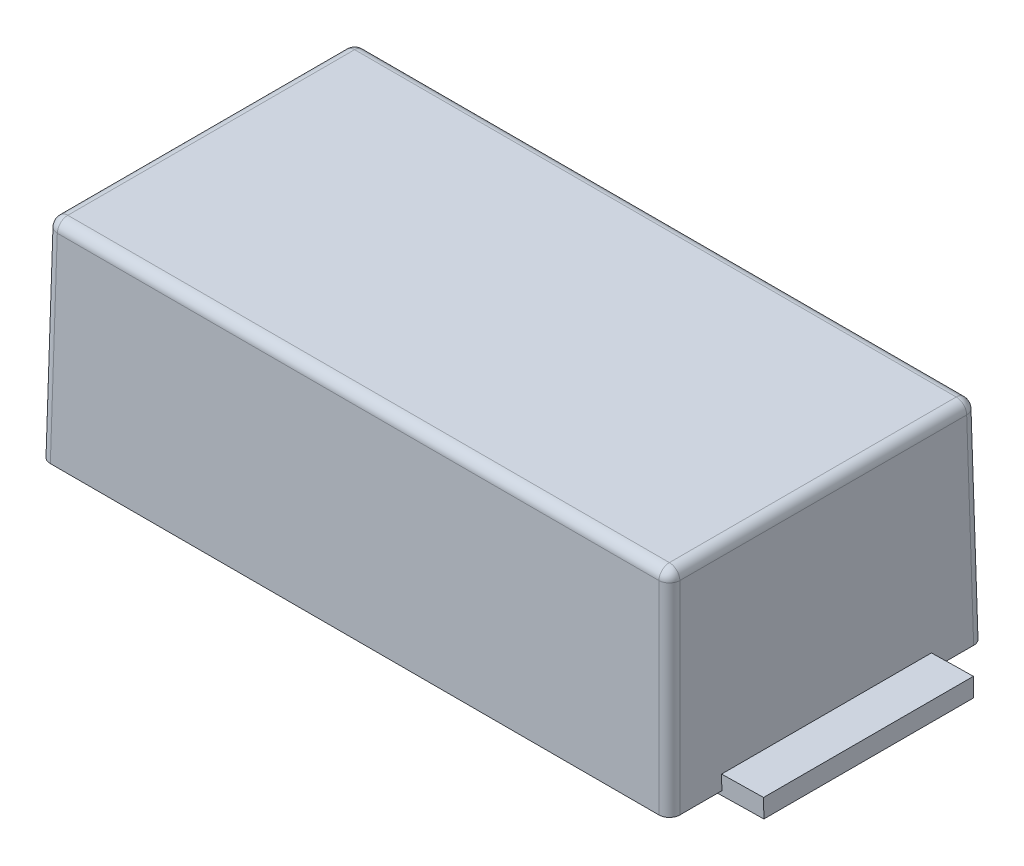
ISO-10303-21;
HEADER;
FILE_DESCRIPTION(('STEP AP214'),'2;1');
FILE_NAME('part.step','',(''),(''),'','','');
FILE_SCHEMA(('AUTOMOTIVE_DESIGN { 1 0 10303 214 1 1 1 1 }'));
ENDSEC;
DATA;
#1=APPLICATION_CONTEXT('core data for automotive mechanical design processes');
#2=APPLICATION_PROTOCOL_DEFINITION('international standard','automotive_design',2000,#1);
#3=PRODUCT_CONTEXT('',#1,'mechanical');
#4=PRODUCT('Part','Part','',(#3));
#5=PRODUCT_RELATED_PRODUCT_CATEGORY('part','',(#4));
#6=PRODUCT_DEFINITION_FORMATION('','',#4);
#7=PRODUCT_DEFINITION_CONTEXT('part definition',#1,'design');
#8=PRODUCT_DEFINITION('design','',#6,#7);
#9=PRODUCT_DEFINITION_SHAPE('','',#8);
#10=(LENGTH_UNIT() NAMED_UNIT(*) SI_UNIT(.MILLI.,.METRE.));
#11=(NAMED_UNIT(*) PLANE_ANGLE_UNIT() SI_UNIT($,.RADIAN.));
#12=(NAMED_UNIT(*) SI_UNIT($,.STERADIAN.) SOLID_ANGLE_UNIT());
#13=UNCERTAINTY_MEASURE_WITH_UNIT(LENGTH_MEASURE(1.E-05),#10,'distance_accuracy_value','');
#14=(GEOMETRIC_REPRESENTATION_CONTEXT(3) GLOBAL_UNCERTAINTY_ASSIGNED_CONTEXT((#13)) GLOBAL_UNIT_ASSIGNED_CONTEXT((#10,
#11,#12)) REPRESENTATION_CONTEXT('',''));
#15=CARTESIAN_POINT('',(0.,0.,0.));
#16=DIRECTION('',(0.,0.,1.));
#17=DIRECTION('',(1.,0.,0.));
#18=AXIS2_PLACEMENT_3D('',#15,#16,#17);
#19=CARTESIAN_POINT('',(0.,0.,0.));
#20=DIRECTION('',(0.,-1.,0.));
#21=DIRECTION('',(0.,0.,-1.));
#22=AXIS2_PLACEMENT_3D('',#19,#20,#21);
#23=PLANE('',#22);
#24=DIRECTION('',(0.,0.,1.));
#25=VECTOR('',#24,1.);
#26=CARTESIAN_POINT('',(-1.5,0.,0.75));
#27=LINE('',#26,#25);
#28=CARTESIAN_POINT('',(-1.5,0.,0.5));
#29=VERTEX_POINT('',#28);
#30=CARTESIAN_POINT('',(-1.5,0.,0.700007615242177));
#31=VERTEX_POINT('',#30);
#32=EDGE_CURVE('E264',#29,#31,#27,.T.);
#33=ORIENTED_EDGE('',*,*,#32,.F.);
#34=DIRECTION('',(1.,0.,0.));
#35=VECTOR('',#34,1.);
#36=CARTESIAN_POINT('',(0.,0.,0.5));
#37=LINE('',#36,#35);
#38=CARTESIAN_POINT('',(-0.999923835978043,0.,0.5));
#39=VERTEX_POINT('',#38);
#40=EDGE_CURVE('E220',#29,#39,#37,.T.);
#41=ORIENTED_EDGE('',*,*,#40,.T.);
#42=DIRECTION('',(0.,0.,-1.));
#43=VECTOR('',#42,1.);
#44=CARTESIAN_POINT('',(-0.999923835978044,0.,0.));
#45=LINE('',#44,#43);
#46=CARTESIAN_POINT('',(-0.999923835978043,0.,-0.5));
#47=VERTEX_POINT('',#46);
#48=EDGE_CURVE('E11',#39,#47,#45,.T.);
#49=ORIENTED_EDGE('',*,*,#48,.T.);
#50=DIRECTION('',(-1.,0.,0.));
#51=VECTOR('',#50,1.);
#52=CARTESIAN_POINT('',(0.,0.,-0.5));
#53=LINE('',#52,#51);
#54=CARTESIAN_POINT('',(-1.5,0.,-0.5));
#55=VERTEX_POINT('',#54);
#56=EDGE_CURVE('E214',#47,#55,#53,.T.);
#57=ORIENTED_EDGE('',*,*,#56,.T.);
#58=CARTESIAN_POINT('',(-1.5,0.,-0.700007615242177));
#59=VERTEX_POINT('',#58);
#60=EDGE_CURVE('E265',#59,#55,#27,.T.);
#61=ORIENTED_EDGE('',*,*,#60,.F.);
#62=CARTESIAN_POINT('',(-1.4499923835978,0.,-0.699992383597801));
#63=DIRECTION('',(0.,-1.,0.));
#64=DIRECTION('',(-0.707106781186545,0.,-0.70710678118655));
#65=AXIS2_PLACEMENT_3D('',#62,#63,#64);
#66=ELLIPSE('',#65,0.0500152316445525,0.05);
#67=CARTESIAN_POINT('',(-1.45000761524218,0.,-0.75));
#68=VERTEX_POINT('',#67);
#69=EDGE_CURVE('E310',#59,#68,#66,.T.);
#70=ORIENTED_EDGE('',*,*,#69,.T.);
#71=DIRECTION('',(-1.,0.,0.));
#72=VECTOR('',#71,1.);
#73=CARTESIAN_POINT('',(-1.5,0.,-0.75));
#74=LINE('',#73,#72);
#75=CARTESIAN_POINT('',(1.45000761524218,0.,-0.75));
#76=VERTEX_POINT('',#75);
#77=EDGE_CURVE('E260',#76,#68,#74,.T.);
#78=ORIENTED_EDGE('',*,*,#77,.F.);
#79=CARTESIAN_POINT('',(1.4499923835978,0.,-0.699992383597801));
#80=DIRECTION('',(0.,-1.,0.));
#81=DIRECTION('',(0.707106781186545,0.,-0.70710678118655));
#82=AXIS2_PLACEMENT_3D('',#79,#80,#81);
#83=ELLIPSE('',#82,0.0500152316445525,0.05);
#84=CARTESIAN_POINT('',(1.5,0.,-0.700007615242177));
#85=VERTEX_POINT('',#84);
#86=EDGE_CURVE('E307',#76,#85,#83,.T.);
#87=ORIENTED_EDGE('',*,*,#86,.T.);
#88=DIRECTION('',(0.,0.,-1.));
#89=VECTOR('',#88,1.);
#90=CARTESIAN_POINT('',(1.5,0.,0.75));
#91=LINE('',#90,#89);
#92=CARTESIAN_POINT('',(1.5,0.,-0.5));
#93=VERTEX_POINT('',#92);
#94=EDGE_CURVE('E261',#93,#85,#91,.T.);
#95=ORIENTED_EDGE('',*,*,#94,.F.);
#96=DIRECTION('',(1.,0.,0.));
#97=VECTOR('',#96,1.);
#98=CARTESIAN_POINT('',(0.,0.,-0.5));
#99=LINE('',#98,#97);
#100=CARTESIAN_POINT('',(0.999923835978044,0.,-0.5));
#101=VERTEX_POINT('',#100);
#102=EDGE_CURVE('E246',#101,#93,#99,.T.);
#103=ORIENTED_EDGE('',*,*,#102,.F.);
#104=DIRECTION('',(0.,0.,1.));
#105=VECTOR('',#104,1.);
#106=CARTESIAN_POINT('',(0.999923835978044,0.,0.));
#107=LINE('',#106,#105);
#108=CARTESIAN_POINT('',(0.999923835978044,0.,0.5));
#109=VERTEX_POINT('',#108);
#110=EDGE_CURVE('E55',#101,#109,#107,.T.);
#111=ORIENTED_EDGE('',*,*,#110,.T.);
#112=DIRECTION('',(-1.,0.,0.));
#113=VECTOR('',#112,1.);
#114=CARTESIAN_POINT('',(0.,0.,0.5));
#115=LINE('',#114,#113);
#116=CARTESIAN_POINT('',(1.5,0.,0.5));
#117=VERTEX_POINT('',#116);
#118=EDGE_CURVE('E254',#117,#109,#115,.T.);
#119=ORIENTED_EDGE('',*,*,#118,.F.);
#120=CARTESIAN_POINT('',(1.5,0.,0.700007615242177));
#121=VERTEX_POINT('',#120);
#122=EDGE_CURVE('E257',#121,#117,#91,.T.);
#123=ORIENTED_EDGE('',*,*,#122,.F.);
#124=CARTESIAN_POINT('',(1.4499923835978,0.,0.699992383597801));
#125=DIRECTION('',(0.,-1.,0.));
#126=DIRECTION('',(-0.707106781186545,0.,-0.70710678118655));
#127=AXIS2_PLACEMENT_3D('',#124,#125,#126);
#128=ELLIPSE('',#127,0.0500152316445525,0.05);
#129=CARTESIAN_POINT('',(1.45000761524218,0.,0.75));
#130=VERTEX_POINT('',#129);
#131=EDGE_CURVE('E305',#121,#130,#128,.T.);
#132=ORIENTED_EDGE('',*,*,#131,.T.);
#133=DIRECTION('',(1.,0.,0.));
#134=VECTOR('',#133,1.);
#135=CARTESIAN_POINT('',(-1.5,0.,0.75));
#136=LINE('',#135,#134);
#137=CARTESIAN_POINT('',(-1.45000761524218,0.,0.75));
#138=VERTEX_POINT('',#137);
#139=EDGE_CURVE('E268',#138,#130,#136,.T.);
#140=ORIENTED_EDGE('',*,*,#139,.F.);
#141=CARTESIAN_POINT('',(-1.4499923835978,0.,0.699992383597801));
#142=DIRECTION('',(0.,-1.,0.));
#143=DIRECTION('',(0.707106781186545,0.,-0.70710678118655));
#144=AXIS2_PLACEMENT_3D('',#141,#142,#143);
#145=ELLIPSE('',#144,0.0500152316445525,0.05);
#146=EDGE_CURVE('E312',#138,#31,#145,.T.);
#147=ORIENTED_EDGE('',*,*,#146,.T.);
#148=EDGE_LOOP('',(#33,#41,#49,#57,#61,#70,#78,#87,#95,#103,#111,#119,#123,#132,#140,#147));
#149=FACE_BOUND('',#148,.T.);
#150=ADVANCED_FACE('F32',(#149),#23,.T.);
#151=CARTESIAN_POINT('',(-1.48254493507178,1.,0.));
#152=DIRECTION('',(0.999847695156391,-0.01745240643728,0.));
#153=DIRECTION('',(0.,0.,1.));
#154=AXIS2_PLACEMENT_3D('',#151,#152,#153);
#155=PLANE('',#154);
#156=DIRECTION('',(0.,0.,-1.));
#157=VECTOR('',#156,1.);
#158=CARTESIAN_POINT('',(-1.49880952804625,0.0682020925527498,0.));
#159=LINE('',#158,#157);
#160=CARTESIAN_POINT('',(-1.49880952804625,0.0682020925527498,-0.5));
#161=VERTEX_POINT('',#160);
#162=CARTESIAN_POINT('',(-1.49880952804625,0.0682020925527498,0.5));
#163=VERTEX_POINT('',#162);
#164=EDGE_CURVE('E358',#161,#163,#159,.F.);
#165=ORIENTED_EDGE('',*,*,#164,.T.);
#166=DIRECTION('',(0.01745240643728,0.999847695156391,0.));
#167=VECTOR('',#166,1.);
#168=CARTESIAN_POINT('',(-1.48254493507178,1.,0.5));
#169=LINE('',#168,#167);
#170=EDGE_CURVE('E40',#163,#29,#169,.F.);
#171=ORIENTED_EDGE('',*,*,#170,.T.);
#172=ORIENTED_EDGE('',*,*,#32,.T.);
#173=DIRECTION('',(-0.0174497491606792,-0.999695459881888,0.0174497491606793));
#174=VECTOR('',#173,1.);
#175=CARTESIAN_POINT('',(-1.48233710208905,1.01190674360623,0.682344717331232));
#176=LINE('',#175,#174);
#177=CARTESIAN_POINT('',(-1.48340245667382,0.950872620321864,0.683410071915998));
#178=VERTEX_POINT('',#177);
#179=EDGE_CURVE('E297',#31,#178,#176,.F.);
#180=ORIENTED_EDGE('',*,*,#179,.T.);
#181=DIRECTION('',(0.,0.,1.));
#182=VECTOR('',#181,1.);
#183=CARTESIAN_POINT('',(-1.48340245667382,0.950872620321864,-0.732544935071783));
#184=LINE('',#183,#182);
#185=CARTESIAN_POINT('',(-1.48340245667382,0.950872620321864,-0.683410071915998));
#186=VERTEX_POINT('',#185);
#187=EDGE_CURVE('E295',#178,#186,#184,.F.);
#188=ORIENTED_EDGE('',*,*,#187,.T.);
#189=DIRECTION('',(0.0174497491606792,0.999695459881888,0.0174497491606793));
#190=VECTOR('',#189,1.);
#191=CARTESIAN_POINT('',(-1.48233710208905,1.01190674360623,-0.682344717331233));
#192=LINE('',#191,#190);
#193=EDGE_CURVE('E293',#186,#59,#192,.F.);
#194=ORIENTED_EDGE('',*,*,#193,.T.);
#195=ORIENTED_EDGE('',*,*,#60,.T.);
#196=DIRECTION('',(-0.01745240643728,-0.999847695156391,0.));
#197=VECTOR('',#196,1.);
#198=CARTESIAN_POINT('',(-1.48254493507178,1.,-0.5));
#199=LINE('',#198,#197);
#200=EDGE_CURVE('E360',#55,#161,#199,.F.);
#201=ORIENTED_EDGE('',*,*,#200,.T.);
#202=EDGE_LOOP('',(#165,#171,#172,#180,#188,#194,#195,#201));
#203=FACE_BOUND('',#202,.T.);
#204=ADVANCED_FACE('F364',(#203),#155,.F.);
#205=CARTESIAN_POINT('',(0.,1.,0.));
#206=DIRECTION('',(0.,-1.,0.));
#207=DIRECTION('',(0.,0.,-1.));
#208=AXIS2_PLACEMENT_3D('',#205,#206,#207);
#209=PLANE('',#208);
#210=DIRECTION('',(-1.,0.,0.));
#211=VECTOR('',#210,1.);
#212=CARTESIAN_POINT('',(1.48254493507178,1.,0.683410071915998));
#213=LINE('',#212,#211);
#214=CARTESIAN_POINT('',(-1.433410071916,1.,0.683410071915998));
#215=VERTEX_POINT('',#214);
#216=CARTESIAN_POINT('',(1.433410071916,1.,0.683410071915998));
#217=VERTEX_POINT('',#216);
#218=EDGE_CURVE('E275',#215,#217,#213,.F.);
#219=ORIENTED_EDGE('',*,*,#218,.T.);
#220=DIRECTION('',(0.,0.,1.));
#221=VECTOR('',#220,1.);
#222=CARTESIAN_POINT('',(1.433410071916,1.,-0.732544935071783));
#223=LINE('',#222,#221);
#224=CARTESIAN_POINT('',(1.433410071916,1.,-0.683410071915998));
#225=VERTEX_POINT('',#224);
#226=EDGE_CURVE('E277',#217,#225,#223,.F.);
#227=ORIENTED_EDGE('',*,*,#226,.T.);
#228=DIRECTION('',(1.,0.,0.));
#229=VECTOR('',#228,1.);
#230=CARTESIAN_POINT('',(-1.48254493507178,1.,-0.683410071915998));
#231=LINE('',#230,#229);
#232=CARTESIAN_POINT('',(-1.433410071916,1.,-0.683410071915998));
#233=VERTEX_POINT('',#232);
#234=EDGE_CURVE('E271',#225,#233,#231,.F.);
#235=ORIENTED_EDGE('',*,*,#234,.T.);
#236=DIRECTION('',(0.,0.,-1.));
#237=VECTOR('',#236,1.);
#238=CARTESIAN_POINT('',(-1.433410071916,1.,0.732544935071782));
#239=LINE('',#238,#237);
#240=EDGE_CURVE('E273',#233,#215,#239,.F.);
#241=ORIENTED_EDGE('',*,*,#240,.T.);
#242=EDGE_LOOP('',(#219,#227,#235,#241));
#243=FACE_BOUND('',#242,.T.);
#244=ADVANCED_FACE('F415',(#243),#209,.F.);
#245=CARTESIAN_POINT('',(1.48254493507178,1.,0.));
#246=DIRECTION('',(-0.999847695156391,-0.01745240643728,0.));
#247=DIRECTION('',(0.,0.,-1.));
#248=AXIS2_PLACEMENT_3D('',#245,#246,#247);
#249=PLANE('',#248);
#250=DIRECTION('',(-0.01745240643728,0.999847695156391,0.));
#251=VECTOR('',#250,1.);
#252=CARTESIAN_POINT('',(1.48254493507178,1.,0.5));
#253=LINE('',#252,#251);
#254=CARTESIAN_POINT('',(1.49880952804625,0.0682020925527498,0.5));
#255=VERTEX_POINT('',#254);
#256=EDGE_CURVE('E354',#255,#117,#253,.F.);
#257=ORIENTED_EDGE('',*,*,#256,.F.);
#258=DIRECTION('',(0.,0.,-1.));
#259=VECTOR('',#258,1.);
#260=CARTESIAN_POINT('',(1.49880952804625,0.0682020925527498,0.));
#261=LINE('',#260,#259);
#262=CARTESIAN_POINT('',(1.49880952804625,0.0682020925527498,-0.5));
#263=VERTEX_POINT('',#262);
#264=EDGE_CURVE('E351',#263,#255,#261,.F.);
#265=ORIENTED_EDGE('',*,*,#264,.F.);
#266=DIRECTION('',(0.01745240643728,-0.999847695156391,0.));
#267=VECTOR('',#266,1.);
#268=CARTESIAN_POINT('',(1.48254493507178,1.,-0.5));
#269=LINE('',#268,#267);
#270=EDGE_CURVE('E315',#93,#263,#269,.F.);
#271=ORIENTED_EDGE('',*,*,#270,.F.);
#272=ORIENTED_EDGE('',*,*,#94,.T.);
#273=DIRECTION('',(-0.0174497491606792,0.999695459881888,0.0174497491606793));
#274=VECTOR('',#273,1.);
#275=CARTESIAN_POINT('',(1.48233710208905,1.01190674360623,-0.682344717331233));
#276=LINE('',#275,#274);
#277=CARTESIAN_POINT('',(1.48340245667382,0.950872620321864,-0.683410071915998));
#278=VERTEX_POINT('',#277);
#279=EDGE_CURVE('E285',#85,#278,#276,.T.);
#280=ORIENTED_EDGE('',*,*,#279,.T.);
#281=DIRECTION('',(0.,0.,-1.));
#282=VECTOR('',#281,1.);
#283=CARTESIAN_POINT('',(1.48340245667382,0.950872620321864,0.732544935071782));
#284=LINE('',#283,#282);
#285=CARTESIAN_POINT('',(1.48340245667382,0.950872620321864,0.683410071915998));
#286=VERTEX_POINT('',#285);
#287=EDGE_CURVE('E282',#278,#286,#284,.F.);
#288=ORIENTED_EDGE('',*,*,#287,.T.);
#289=DIRECTION('',(0.0174497491606792,-0.999695459881888,0.0174497491606793));
#290=VECTOR('',#289,1.);
#291=CARTESIAN_POINT('',(1.48233710208905,1.01190674360623,0.682344717331232));
#292=LINE('',#291,#290);
#293=EDGE_CURVE('E280',#286,#121,#292,.T.);
#294=ORIENTED_EDGE('',*,*,#293,.T.);
#295=ORIENTED_EDGE('',*,*,#122,.T.);
#296=EDGE_LOOP('',(#257,#265,#271,#272,#280,#288,#294,#295));
#297=FACE_BOUND('',#296,.T.);
#298=ADVANCED_FACE('F427',(#297),#249,.F.);
#299=CARTESIAN_POINT('',(0.,1.,-0.732544935071783));
#300=DIRECTION('',(0.,-0.0174524064372801,0.999847695156391));
#301=DIRECTION('',(-1.,0.,0.));
#302=AXIS2_PLACEMENT_3D('',#299,#300,#301);
#303=PLANE('',#302);
#304=ORIENTED_EDGE('',*,*,#77,.T.);
#305=DIRECTION('',(0.0174497491606792,0.999695459881888,0.0174497491606793));
#306=VECTOR('',#305,1.);
#307=CARTESIAN_POINT('',(-1.4321163470219,1.02499006986524,-0.732108731779724));
#308=LINE('',#307,#306);
#309=CARTESIAN_POINT('',(-1.433410071916,0.950872620321864,-0.733402456673818));
#310=VERTEX_POINT('',#309);
#311=EDGE_CURVE('E303',#68,#310,#308,.T.);
#312=ORIENTED_EDGE('',*,*,#311,.T.);
#313=DIRECTION('',(-1.,0.,0.));
#314=VECTOR('',#313,1.);
#315=CARTESIAN_POINT('',(1.48254493507178,0.950872620321864,-0.733402456673818));
#316=LINE('',#315,#314);
#317=CARTESIAN_POINT('',(1.433410071916,0.950872620321864,-0.733402456673818));
#318=VERTEX_POINT('',#317);
#319=EDGE_CURVE('E301',#310,#318,#316,.F.);
#320=ORIENTED_EDGE('',*,*,#319,.T.);
#321=DIRECTION('',(-0.0174497491606792,0.999695459881888,0.0174497491606793));
#322=VECTOR('',#321,1.);
#323=CARTESIAN_POINT('',(1.4321163470219,1.02499006986524,-0.732108731779724));
#324=LINE('',#323,#322);
#325=EDGE_CURVE('E299',#318,#76,#324,.F.);
#326=ORIENTED_EDGE('',*,*,#325,.T.);
#327=EDGE_LOOP('',(#304,#312,#320,#326));
#328=FACE_BOUND('',#327,.T.);
#329=ADVANCED_FACE('F423',(#328),#303,.F.);
#330=CARTESIAN_POINT('',(0.,1.,0.732544935071782));
#331=DIRECTION('',(0.,-0.0174524064372801,-0.999847695156391));
#332=DIRECTION('',(1.,0.,0.));
#333=AXIS2_PLACEMENT_3D('',#330,#331,#332);
#334=PLANE('',#333);
#335=DIRECTION('',(1.,0.,0.));
#336=VECTOR('',#335,1.);
#337=CARTESIAN_POINT('',(-1.48254493507178,0.950872620321864,0.733402456673817));
#338=LINE('',#337,#336);
#339=CARTESIAN_POINT('',(1.433410071916,0.950872620321864,0.733402456673817));
#340=VERTEX_POINT('',#339);
#341=CARTESIAN_POINT('',(-1.433410071916,0.950872620321864,0.733402456673817));
#342=VERTEX_POINT('',#341);
#343=EDGE_CURVE('E289',#340,#342,#338,.F.);
#344=ORIENTED_EDGE('',*,*,#343,.T.);
#345=DIRECTION('',(-0.0174497491606792,-0.999695459881888,0.0174497491606793));
#346=VECTOR('',#345,1.);
#347=CARTESIAN_POINT('',(-1.4321163470219,1.02499006986524,0.732108731779724));
#348=LINE('',#347,#346);
#349=EDGE_CURVE('E291',#342,#138,#348,.T.);
#350=ORIENTED_EDGE('',*,*,#349,.T.);
#351=ORIENTED_EDGE('',*,*,#139,.T.);
#352=DIRECTION('',(0.0174497491606792,-0.999695459881888,0.0174497491606793));
#353=VECTOR('',#352,1.);
#354=CARTESIAN_POINT('',(1.4321163470219,1.02499006986524,0.732108731779724));
#355=LINE('',#354,#353);
#356=EDGE_CURVE('E287',#130,#340,#355,.F.);
#357=ORIENTED_EDGE('',*,*,#356,.T.);
#358=EDGE_LOOP('',(#344,#350,#351,#357));
#359=FACE_BOUND('',#358,.T.);
#360=ADVANCED_FACE('F420',(#359),#334,.F.);
#361=CARTESIAN_POINT('',(-1.43234471733123,1.01103412328437,0.682344717331232));
#362=DIRECTION('',(0.0174497491606792,0.999695459881888,-0.0174497491606793));
#363=DIRECTION('',(0.,0.0174524064372801,0.999847695156391));
#364=AXIS2_PLACEMENT_3D('',#361,#362,#363);
#365=CYLINDRICAL_SURFACE('',#364,0.05);
#366=ORIENTED_EDGE('',*,*,#146,.F.);
#367=ORIENTED_EDGE('',*,*,#349,.F.);
#368=CARTESIAN_POINT('',(-1.433410071916,0.95,0.683410071915998));
#369=DIRECTION('',(0.01744974916068,0.999695459881888,-0.01744974916068));
#370=DIRECTION('',(0.,0.0174524064372809,0.999847695156391));
#371=AXIS2_PLACEMENT_3D('',#368,#369,#370);
#372=CIRCLE('',#371,0.05);
#373=EDGE_CURVE('E346',#178,#342,#372,.T.);
#374=ORIENTED_EDGE('',*,*,#373,.F.);
#375=ORIENTED_EDGE('',*,*,#179,.F.);
#376=EDGE_LOOP('',(#366,#367,#374,#375));
#377=FACE_BOUND('',#376,.T.);
#378=ADVANCED_FACE('F34',(#377),#365,.T.);
#379=CARTESIAN_POINT('',(-1.433410071916,0.95,0.));
#380=DIRECTION('',(0.,0.,1.));
#381=DIRECTION('',(1.,0.,0.));
#382=AXIS2_PLACEMENT_3D('',#379,#380,#381);
#383=CYLINDRICAL_SURFACE('',#382,0.05);
#384=CARTESIAN_POINT('',(-1.433410071916,0.95,-0.683410071915998));
#385=DIRECTION('',(0.,0.,-1.));
#386=DIRECTION('',(0.,1.,0.));
#387=AXIS2_PLACEMENT_3D('',#384,#385,#386);
#388=CIRCLE('',#387,0.05);
#389=EDGE_CURVE('E340',#186,#233,#388,.T.);
#390=ORIENTED_EDGE('',*,*,#389,.F.);
#391=ORIENTED_EDGE('',*,*,#187,.F.);
#392=CARTESIAN_POINT('',(-1.433410071916,0.95,0.683410071915998));
#393=DIRECTION('',(0.,0.,1.));
#394=DIRECTION('',(1.,0.,0.));
#395=AXIS2_PLACEMENT_3D('',#392,#393,#394);
#396=CIRCLE('',#395,0.05);
#397=EDGE_CURVE('E343',#215,#178,#396,.T.);
#398=ORIENTED_EDGE('',*,*,#397,.F.);
#399=ORIENTED_EDGE('',*,*,#240,.F.);
#400=EDGE_LOOP('',(#390,#391,#398,#399));
#401=FACE_BOUND('',#400,.T.);
#402=ADVANCED_FACE('F376',(#401),#383,.T.);
#403=CARTESIAN_POINT('',(-1.43234471733123,1.01103412328437,-0.682344717331233));
#404=DIRECTION('',(-0.0174497491606792,-0.999695459881888,-0.0174497491606793));
#405=DIRECTION('',(0.,0.0174524064372801,-0.999847695156391));
#406=AXIS2_PLACEMENT_3D('',#403,#404,#405);
#407=CYLINDRICAL_SURFACE('',#406,0.05);
#408=ORIENTED_EDGE('',*,*,#69,.F.);
#409=ORIENTED_EDGE('',*,*,#193,.F.);
#410=CARTESIAN_POINT('',(-1.433410071916,0.95,-0.683410071915998));
#411=DIRECTION('',(0.0174497491606799,0.999695459881888,0.01744974916068));
#412=DIRECTION('',(0.,-0.0174524064372808,0.999847695156391));
#413=AXIS2_PLACEMENT_3D('',#410,#411,#412);
#414=CIRCLE('',#413,0.05);
#415=EDGE_CURVE('E337',#310,#186,#414,.T.);
#416=ORIENTED_EDGE('',*,*,#415,.F.);
#417=ORIENTED_EDGE('',*,*,#311,.F.);
#418=EDGE_LOOP('',(#408,#409,#416,#417));
#419=FACE_BOUND('',#418,.T.);
#420=ADVANCED_FACE('F387',(#419),#407,.T.);
#421=CARTESIAN_POINT('',(-1.433410071916,0.95,0.683410071915998));
#422=DIRECTION('',(0.,0.,1.));
#423=DIRECTION('',(1.,0.,0.));
#424=AXIS2_PLACEMENT_3D('',#421,#422,#423);
#425=SPHERICAL_SURFACE('',#424,0.05);
#426=ORIENTED_EDGE('',*,*,#397,.T.);
#427=ORIENTED_EDGE('',*,*,#373,.T.);
#428=CARTESIAN_POINT('',(-1.433410071916,0.95,0.683410071915998));
#429=DIRECTION('',(-1.,0.,0.));
#430=DIRECTION('',(0.,-1.,0.));
#431=AXIS2_PLACEMENT_3D('',#428,#429,#430);
#432=CIRCLE('',#431,0.05);
#433=EDGE_CURVE('E334',#215,#342,#432,.F.);
#434=ORIENTED_EDGE('',*,*,#433,.F.);
#435=EDGE_LOOP('',(#426,#427,#434));
#436=FACE_BOUND('',#435,.T.);
#437=ADVANCED_FACE('F463',(#436),#425,.T.);
#438=CARTESIAN_POINT('',(-1.433410071916,0.95,-0.683410071915998));
#439=DIRECTION('',(0.,0.,1.));
#440=DIRECTION('',(1.,0.,0.));
#441=AXIS2_PLACEMENT_3D('',#438,#439,#440);
#442=SPHERICAL_SURFACE('',#441,0.05);
#443=ORIENTED_EDGE('',*,*,#415,.T.);
#444=ORIENTED_EDGE('',*,*,#389,.T.);
#445=CARTESIAN_POINT('',(-1.433410071916,0.95,-0.683410071915998));
#446=DIRECTION('',(-1.,0.,0.));
#447=DIRECTION('',(0.,0.,1.));
#448=AXIS2_PLACEMENT_3D('',#445,#446,#447);
#449=CIRCLE('',#448,0.05);
#450=EDGE_CURVE('E331',#310,#233,#449,.F.);
#451=ORIENTED_EDGE('',*,*,#450,.F.);
#452=EDGE_LOOP('',(#443,#444,#451));
#453=FACE_BOUND('',#452,.T.);
#454=ADVANCED_FACE('F382',(#453),#442,.T.);
#455=CARTESIAN_POINT('',(1.4321163470219,1.02411744954338,0.682116347021904));
#456=DIRECTION('',(-0.0174497491606792,0.999695459881888,-0.0174497491606793));
#457=DIRECTION('',(0.,0.0174524064372801,0.999847695156391));
#458=AXIS2_PLACEMENT_3D('',#455,#456,#457);
#459=CYLINDRICAL_SURFACE('',#458,0.05);
#460=ORIENTED_EDGE('',*,*,#131,.F.);
#461=ORIENTED_EDGE('',*,*,#293,.F.);
#462=CARTESIAN_POINT('',(1.433410071916,0.95,0.683410071915998));
#463=DIRECTION('',(-0.0174497491606799,0.999695459881888,-0.01744974916068));
#464=DIRECTION('',(0.,0.0174524064372808,0.999847695156391));
#465=AXIS2_PLACEMENT_3D('',#462,#463,#464);
#466=CIRCLE('',#465,0.05);
#467=EDGE_CURVE('E328',#340,#286,#466,.T.);
#468=ORIENTED_EDGE('',*,*,#467,.F.);
#469=ORIENTED_EDGE('',*,*,#356,.F.);
#470=EDGE_LOOP('',(#460,#461,#468,#469));
#471=FACE_BOUND('',#470,.T.);
#472=ADVANCED_FACE('F456',(#471),#459,.T.);
#473=CARTESIAN_POINT('',(0.,0.95,0.683410071915998));
#474=DIRECTION('',(1.,0.,0.));
#475=DIRECTION('',(0.,0.,-1.));
#476=AXIS2_PLACEMENT_3D('',#473,#474,#475);
#477=CYLINDRICAL_SURFACE('',#476,0.05);
#478=ORIENTED_EDGE('',*,*,#433,.T.);
#479=ORIENTED_EDGE('',*,*,#343,.F.);
#480=CARTESIAN_POINT('',(1.433410071916,0.95,0.683410071915998));
#481=DIRECTION('',(1.,0.,0.));
#482=DIRECTION('',(0.,0.,-1.));
#483=AXIS2_PLACEMENT_3D('',#480,#481,#482);
#484=CIRCLE('',#483,0.05);
#485=EDGE_CURVE('E325',#217,#340,#484,.T.);
#486=ORIENTED_EDGE('',*,*,#485,.F.);
#487=ORIENTED_EDGE('',*,*,#218,.F.);
#488=EDGE_LOOP('',(#478,#479,#486,#487));
#489=FACE_BOUND('',#488,.T.);
#490=ADVANCED_FACE('F452',(#489),#477,.T.);
#491=CARTESIAN_POINT('',(0.,0.95,-0.683410071915998));
#492=DIRECTION('',(-1.,0.,0.));
#493=DIRECTION('',(0.,0.,1.));
#494=AXIS2_PLACEMENT_3D('',#491,#492,#493);
#495=CYLINDRICAL_SURFACE('',#494,0.05);
#496=ORIENTED_EDGE('',*,*,#450,.T.);
#497=ORIENTED_EDGE('',*,*,#234,.F.);
#498=CARTESIAN_POINT('',(1.433410071916,0.95,-0.683410071915998));
#499=DIRECTION('',(1.,0.,0.));
#500=DIRECTION('',(0.,1.,0.));
#501=AXIS2_PLACEMENT_3D('',#498,#499,#500);
#502=CIRCLE('',#501,0.05);
#503=EDGE_CURVE('E322',#318,#225,#502,.T.);
#504=ORIENTED_EDGE('',*,*,#503,.F.);
#505=ORIENTED_EDGE('',*,*,#319,.F.);
#506=EDGE_LOOP('',(#496,#497,#504,#505));
#507=FACE_BOUND('',#506,.T.);
#508=ADVANCED_FACE('F448',(#507),#495,.T.);
#509=CARTESIAN_POINT('',(1.4321163470219,1.02411744954338,-0.682116347021905));
#510=DIRECTION('',(0.0174497491606792,-0.999695459881888,-0.0174497491606793));
#511=DIRECTION('',(0.,0.0174524064372801,-0.999847695156391));
#512=AXIS2_PLACEMENT_3D('',#509,#510,#511);
#513=CYLINDRICAL_SURFACE('',#512,0.05);
#514=ORIENTED_EDGE('',*,*,#86,.F.);
#515=ORIENTED_EDGE('',*,*,#325,.F.);
#516=CARTESIAN_POINT('',(1.433410071916,0.95,-0.683410071915998));
#517=DIRECTION('',(-0.01744974916068,0.999695459881888,0.01744974916068));
#518=DIRECTION('',(0.,-0.0174524064372809,0.999847695156391));
#519=AXIS2_PLACEMENT_3D('',#516,#517,#518);
#520=CIRCLE('',#519,0.05);
#521=EDGE_CURVE('E319',#278,#318,#520,.T.);
#522=ORIENTED_EDGE('',*,*,#521,.F.);
#523=ORIENTED_EDGE('',*,*,#279,.F.);
#524=EDGE_LOOP('',(#514,#515,#522,#523));
#525=FACE_BOUND('',#524,.T.);
#526=ADVANCED_FACE('F444',(#525),#513,.T.);
#527=CARTESIAN_POINT('',(1.433410071916,0.95,0.683410071915998));
#528=DIRECTION('',(0.,0.,1.));
#529=DIRECTION('',(1.,0.,0.));
#530=AXIS2_PLACEMENT_3D('',#527,#528,#529);
#531=SPHERICAL_SURFACE('',#530,0.05);
#532=ORIENTED_EDGE('',*,*,#485,.T.);
#533=ORIENTED_EDGE('',*,*,#467,.T.);
#534=CARTESIAN_POINT('',(1.433410071916,0.95,0.683410071915998));
#535=DIRECTION('',(0.,0.,1.));
#536=DIRECTION('',(1.,0.,0.));
#537=AXIS2_PLACEMENT_3D('',#534,#535,#536);
#538=CIRCLE('',#537,0.05);
#539=EDGE_CURVE('E317',#217,#286,#538,.F.);
#540=ORIENTED_EDGE('',*,*,#539,.F.);
#541=EDGE_LOOP('',(#532,#533,#540));
#542=FACE_BOUND('',#541,.T.);
#543=ADVANCED_FACE('F440',(#542),#531,.T.);
#544=CARTESIAN_POINT('',(1.433410071916,0.95,-0.683410071915998));
#545=DIRECTION('',(0.,0.,1.));
#546=DIRECTION('',(1.,0.,0.));
#547=AXIS2_PLACEMENT_3D('',#544,#545,#546);
#548=SPHERICAL_SURFACE('',#547,0.05);
#549=ORIENTED_EDGE('',*,*,#521,.T.);
#550=ORIENTED_EDGE('',*,*,#503,.T.);
#551=CARTESIAN_POINT('',(1.433410071916,0.95,-0.683410071915998));
#552=DIRECTION('',(0.,0.,-1.));
#553=DIRECTION('',(-1.,0.,0.));
#554=AXIS2_PLACEMENT_3D('',#551,#552,#553);
#555=CIRCLE('',#554,0.05);
#556=EDGE_CURVE('E256',#278,#225,#555,.F.);
#557=ORIENTED_EDGE('',*,*,#556,.F.);
#558=EDGE_LOOP('',(#549,#550,#557));
#559=FACE_BOUND('',#558,.T.);
#560=ADVANCED_FACE('F436',(#559),#548,.T.);
#561=CARTESIAN_POINT('',(1.433410071916,0.95,0.));
#562=DIRECTION('',(0.,0.,-1.));
#563=DIRECTION('',(-1.,0.,0.));
#564=AXIS2_PLACEMENT_3D('',#561,#562,#563);
#565=CYLINDRICAL_SURFACE('',#564,0.05);
#566=ORIENTED_EDGE('',*,*,#539,.T.);
#567=ORIENTED_EDGE('',*,*,#287,.F.);
#568=ORIENTED_EDGE('',*,*,#556,.T.);
#569=ORIENTED_EDGE('',*,*,#226,.F.);
#570=EDGE_LOOP('',(#566,#567,#568,#569));
#571=FACE_BOUND('',#570,.T.);
#572=ADVANCED_FACE('F432',(#571),#565,.T.);
#573=CARTESIAN_POINT('',(0.998885680468053,0.0594758893341098,0.5));
#574=DIRECTION('',(0.,0.,1.));
#575=DIRECTION('',(1.,0.,0.));
#576=AXIS2_PLACEMENT_3D('',#573,#574,#575);
#577=PLANE('',#576);
#578=ORIENTED_EDGE('',*,*,#256,.T.);
#579=ORIENTED_EDGE('',*,*,#118,.T.);
#580=DIRECTION('',(0.0174524064372791,-0.999847695156391,0.));
#581=VECTOR('',#580,1.);
#582=CARTESIAN_POINT('',(0.998885680468053,0.0594758893341098,0.5));
#583=LINE('',#582,#581);
#584=CARTESIAN_POINT('',(1.00042520055055,-0.0287231571217679,0.5));
#585=VERTEX_POINT('',#584);
#586=EDGE_CURVE('E235',#109,#585,#583,.T.);
#587=ORIENTED_EDGE('',*,*,#586,.T.);
#588=DIRECTION('',(0.999847695156391,0.01745240643728,0.));
#589=VECTOR('',#588,1.);
#590=CARTESIAN_POINT('',(1.00042520055055,-0.0287231571217679,0.5));
#591=LINE('',#590,#589);
#592=CARTESIAN_POINT('',(1.70031858716002,-0.0165064726156719,0.5));
#593=VERTEX_POINT('',#592);
#594=EDGE_CURVE('E243',#585,#593,#591,.T.);
#595=ORIENTED_EDGE('',*,*,#594,.T.);
#596=DIRECTION('',(0.0174524064372791,-0.999847695156391,0.));
#597=VECTOR('',#596,1.);
#598=CARTESIAN_POINT('',(1.69877906707753,0.0716925738402058,0.5));
#599=LINE('',#598,#597);
#600=CARTESIAN_POINT('',(1.69877906707753,0.0716925738402058,0.5));
#601=VERTEX_POINT('',#600);
#602=EDGE_CURVE('E223',#601,#593,#599,.T.);
#603=ORIENTED_EDGE('',*,*,#602,.F.);
#604=DIRECTION('',(0.999847695156391,0.01745240643728,0.));
#605=VECTOR('',#604,1.);
#606=CARTESIAN_POINT('',(0.998885680468053,0.0594758893341098,0.5));
#607=LINE('',#606,#605);
#608=EDGE_CURVE('E244',#255,#601,#607,.T.);
#609=ORIENTED_EDGE('',*,*,#608,.F.);
#610=EDGE_LOOP('',(#578,#579,#587,#595,#603,#609));
#611=FACE_BOUND('',#610,.T.);
#612=ADVANCED_FACE('F435',(#611),#577,.T.);
#613=CARTESIAN_POINT('',(0.998885680468053,0.0594758893341098,0.5));
#614=DIRECTION('',(-0.01745240643728,0.999847695156391,0.));
#615=DIRECTION('',(-0.999847695156391,-0.01745240643728,0.));
#616=AXIS2_PLACEMENT_3D('',#613,#614,#615);
#617=PLANE('',#616);
#618=DIRECTION('',(0.999847695156391,0.01745240643728,0.));
#619=VECTOR('',#618,1.);
#620=CARTESIAN_POINT('',(0.998885680468053,0.0594758893341098,-0.5));
#621=LINE('',#620,#619);
#622=CARTESIAN_POINT('',(1.69877906707753,0.0716925738402058,-0.5));
#623=VERTEX_POINT('',#622);
#624=EDGE_CURVE('E247',#263,#623,#621,.T.);
#625=ORIENTED_EDGE('',*,*,#624,.F.);
#626=ORIENTED_EDGE('',*,*,#264,.T.);
#627=ORIENTED_EDGE('',*,*,#608,.T.);
#628=DIRECTION('',(0.,0.,1.));
#629=VECTOR('',#628,1.);
#630=CARTESIAN_POINT('',(1.69877906707753,0.0716925738402058,0.5));
#631=LINE('',#630,#629);
#632=EDGE_CURVE('E232',#623,#601,#631,.T.);
#633=ORIENTED_EDGE('',*,*,#632,.F.);
#634=EDGE_LOOP('',(#625,#626,#627,#633));
#635=FACE_BOUND('',#634,.T.);
#636=ADVANCED_FACE('F554',(#635),#617,.T.);
#637=CARTESIAN_POINT('',(0.998885680468053,0.0594758893341098,-0.5));
#638=DIRECTION('',(0.,0.,-1.));
#639=DIRECTION('',(-1.,0.,0.));
#640=AXIS2_PLACEMENT_3D('',#637,#638,#639);
#641=PLANE('',#640);
#642=DIRECTION('',(-0.0174524064372791,0.999847695156391,0.));
#643=VECTOR('',#642,1.);
#644=CARTESIAN_POINT('',(0.998885680468053,0.0594758893341098,-0.5));
#645=LINE('',#644,#643);
#646=CARTESIAN_POINT('',(1.00042520055055,-0.0287231571217679,-0.5));
#647=VERTEX_POINT('',#646);
#648=EDGE_CURVE('E240',#647,#101,#645,.T.);
#649=ORIENTED_EDGE('',*,*,#648,.T.);
#650=ORIENTED_EDGE('',*,*,#102,.T.);
#651=ORIENTED_EDGE('',*,*,#270,.T.);
#652=ORIENTED_EDGE('',*,*,#624,.T.);
#653=DIRECTION('',(-0.0174524064372791,0.999847695156391,0.));
#654=VECTOR('',#653,1.);
#655=CARTESIAN_POINT('',(1.69877906707753,0.0716925738402058,-0.5));
#656=LINE('',#655,#654);
#657=CARTESIAN_POINT('',(1.70031858716002,-0.0165064726156719,-0.5));
#658=VERTEX_POINT('',#657);
#659=EDGE_CURVE('E229',#658,#623,#656,.T.);
#660=ORIENTED_EDGE('',*,*,#659,.F.);
#661=DIRECTION('',(0.999847695156391,0.01745240643728,0.));
#662=VECTOR('',#661,1.);
#663=CARTESIAN_POINT('',(1.00042520055055,-0.0287231571217679,-0.5));
#664=LINE('',#663,#662);
#665=EDGE_CURVE('E249',#647,#658,#664,.T.);
#666=ORIENTED_EDGE('',*,*,#665,.F.);
#667=EDGE_LOOP('',(#649,#650,#651,#652,#660,#666));
#668=FACE_BOUND('',#667,.T.);
#669=ADVANCED_FACE('F557',(#668),#641,.T.);
#670=CARTESIAN_POINT('',(1.00042520055055,-0.0287231571217679,0.5));
#671=DIRECTION('',(0.01745240643728,-0.999847695156391,0.));
#672=DIRECTION('',(0.999847695156391,0.01745240643728,0.));
#673=AXIS2_PLACEMENT_3D('',#670,#671,#672);
#674=PLANE('',#673);
#675=ORIENTED_EDGE('',*,*,#665,.T.);
#676=DIRECTION('',(0.,0.,-1.));
#677=VECTOR('',#676,1.);
#678=CARTESIAN_POINT('',(1.70031858716002,-0.0165064726156719,0.5));
#679=LINE('',#678,#677);
#680=EDGE_CURVE('E226',#593,#658,#679,.T.);
#681=ORIENTED_EDGE('',*,*,#680,.F.);
#682=ORIENTED_EDGE('',*,*,#594,.F.);
#683=DIRECTION('',(0.,0.,-1.));
#684=VECTOR('',#683,1.);
#685=CARTESIAN_POINT('',(1.00042520055055,-0.0287231571217679,0.5));
#686=LINE('',#685,#684);
#687=EDGE_CURVE('E237',#585,#647,#686,.T.);
#688=ORIENTED_EDGE('',*,*,#687,.T.);
#689=EDGE_LOOP('',(#675,#681,#682,#688));
#690=FACE_BOUND('',#689,.T.);
#691=ADVANCED_FACE('F552',(#690),#674,.T.);
#692=CARTESIAN_POINT('',(0.999619272686124,0.0174484193082291,0.));
#693=DIRECTION('',(0.999847695156391,0.0174524064372791,0.));
#694=DIRECTION('',(-0.0174524064372791,0.999847695156391,0.));
#695=AXIS2_PLACEMENT_3D('',#692,#693,#694);
#696=PLANE('',#695);
#697=ORIENTED_EDGE('',*,*,#110,.F.);
#698=ORIENTED_EDGE('',*,*,#648,.F.);
#699=ORIENTED_EDGE('',*,*,#687,.F.);
#700=ORIENTED_EDGE('',*,*,#586,.F.);
#701=EDGE_LOOP('',(#697,#698,#699,#700));
#702=FACE_BOUND('',#701,.T.);
#703=ADVANCED_FACE('F548',(#702),#696,.F.);
#704=CARTESIAN_POINT('',(1.6995126592956,0.0296651038143251,0.));
#705=DIRECTION('',(0.999847695156391,0.0174524064372791,0.));
#706=DIRECTION('',(-0.0174524064372791,0.999847695156391,0.));
#707=AXIS2_PLACEMENT_3D('',#704,#705,#706);
#708=PLANE('',#707);
#709=ORIENTED_EDGE('',*,*,#602,.T.);
#710=ORIENTED_EDGE('',*,*,#680,.T.);
#711=ORIENTED_EDGE('',*,*,#659,.T.);
#712=ORIENTED_EDGE('',*,*,#632,.T.);
#713=EDGE_LOOP('',(#709,#710,#711,#712));
#714=FACE_BOUND('',#713,.T.);
#715=ADVANCED_FACE('F407',(#714),#708,.T.);
#716=CARTESIAN_POINT('',(-0.998885680468053,0.0594758893341098,0.5));
#717=DIRECTION('',(0.,0.,-1.));
#718=DIRECTION('',(-1.,0.,0.));
#719=AXIS2_PLACEMENT_3D('',#716,#717,#718);
#720=PLANE('',#719);
#721=ORIENTED_EDGE('',*,*,#40,.F.);
#722=ORIENTED_EDGE('',*,*,#170,.F.);
#723=DIRECTION('',(-0.999847695156391,0.01745240643728,0.));
#724=VECTOR('',#723,1.);
#725=CARTESIAN_POINT('',(-0.998885680468053,0.0594758893341098,0.5));
#726=LINE('',#725,#724);
#727=CARTESIAN_POINT('',(-1.69877906707753,0.0716925738402058,0.5));
#728=VERTEX_POINT('',#727);
#729=EDGE_CURVE('E47',#163,#728,#726,.T.);
#730=ORIENTED_EDGE('',*,*,#729,.T.);
#731=DIRECTION('',(-0.0174524064372791,-0.999847695156391,0.));
#732=VECTOR('',#731,1.);
#733=CARTESIAN_POINT('',(-1.69877906707753,0.0716925738402058,0.5));
#734=LINE('',#733,#732);
#735=CARTESIAN_POINT('',(-1.70031858716002,-0.0165064726156719,0.5));
#736=VERTEX_POINT('',#735);
#737=EDGE_CURVE('E183',#728,#736,#734,.T.);
#738=ORIENTED_EDGE('',*,*,#737,.T.);
#739=DIRECTION('',(-0.999847695156391,0.01745240643728,0.));
#740=VECTOR('',#739,1.);
#741=CARTESIAN_POINT('',(-1.00042520055055,-0.0287231571217679,0.5));
#742=LINE('',#741,#740);
#743=CARTESIAN_POINT('',(-1.00042520055055,-0.0287231571217679,0.5));
#744=VERTEX_POINT('',#743);
#745=EDGE_CURVE('E212',#744,#736,#742,.T.);
#746=ORIENTED_EDGE('',*,*,#745,.F.);
#747=DIRECTION('',(-0.0174524064372791,-0.999847695156391,0.));
#748=VECTOR('',#747,1.);
#749=CARTESIAN_POINT('',(-0.998885680468053,0.0594758893341098,0.5));
#750=LINE('',#749,#748);
#751=EDGE_CURVE('E206',#39,#744,#750,.T.);
#752=ORIENTED_EDGE('',*,*,#751,.F.);
#753=EDGE_LOOP('',(#721,#722,#730,#738,#746,#752));
#754=FACE_BOUND('',#753,.T.);
#755=ADVANCED_FACE('F181',(#754),#720,.F.);
#756=CARTESIAN_POINT('',(-1.00042520055055,-0.0287231571217679,0.5));
#757=DIRECTION('',(0.01745240643728,0.999847695156391,0.));
#758=DIRECTION('',(-0.999847695156391,0.01745240643728,0.));
#759=AXIS2_PLACEMENT_3D('',#756,#757,#758);
#760=PLANE('',#759);
#761=ORIENTED_EDGE('',*,*,#745,.T.);
#762=DIRECTION('',(0.,0.,-1.));
#763=VECTOR('',#762,1.);
#764=CARTESIAN_POINT('',(-1.70031858716002,-0.0165064726156719,0.5));
#765=LINE('',#764,#763);
#766=CARTESIAN_POINT('',(-1.70031858716002,-0.0165064726156719,-0.5));
#767=VERTEX_POINT('',#766);
#768=EDGE_CURVE('E197',#736,#767,#765,.T.);
#769=ORIENTED_EDGE('',*,*,#768,.T.);
#770=DIRECTION('',(-0.999847695156391,0.01745240643728,0.));
#771=VECTOR('',#770,1.);
#772=CARTESIAN_POINT('',(-1.00042520055055,-0.0287231571217679,-0.5));
#773=LINE('',#772,#771);
#774=CARTESIAN_POINT('',(-1.00042520055055,-0.0287231571217679,-0.5));
#775=VERTEX_POINT('',#774);
#776=EDGE_CURVE('E215',#775,#767,#773,.T.);
#777=ORIENTED_EDGE('',*,*,#776,.F.);
#778=DIRECTION('',(0.,0.,-1.));
#779=VECTOR('',#778,1.);
#780=CARTESIAN_POINT('',(-1.00042520055055,-0.0287231571217679,0.5));
#781=LINE('',#780,#779);
#782=EDGE_CURVE('E188',#744,#775,#781,.T.);
#783=ORIENTED_EDGE('',*,*,#782,.F.);
#784=EDGE_LOOP('',(#761,#769,#777,#783));
#785=FACE_BOUND('',#784,.T.);
#786=ADVANCED_FACE('F399',(#785),#760,.F.);
#787=CARTESIAN_POINT('',(-0.998885680468053,0.0594758893341098,-0.5));
#788=DIRECTION('',(0.,0.,1.));
#789=DIRECTION('',(1.,0.,0.));
#790=AXIS2_PLACEMENT_3D('',#787,#788,#789);
#791=PLANE('',#790);
#792=ORIENTED_EDGE('',*,*,#56,.F.);
#793=DIRECTION('',(0.0174524064372791,0.999847695156391,0.));
#794=VECTOR('',#793,1.);
#795=CARTESIAN_POINT('',(-0.998885680468053,0.0594758893341098,-0.5));
#796=LINE('',#795,#794);
#797=EDGE_CURVE('E208',#775,#47,#796,.T.);
#798=ORIENTED_EDGE('',*,*,#797,.F.);
#799=ORIENTED_EDGE('',*,*,#776,.T.);
#800=DIRECTION('',(0.0174524064372791,0.999847695156391,0.));
#801=VECTOR('',#800,1.);
#802=CARTESIAN_POINT('',(-1.69877906707753,0.0716925738402058,-0.5));
#803=LINE('',#802,#801);
#804=CARTESIAN_POINT('',(-1.69877906707753,0.0716925738402058,-0.5));
#805=VERTEX_POINT('',#804);
#806=EDGE_CURVE('E201',#767,#805,#803,.T.);
#807=ORIENTED_EDGE('',*,*,#806,.T.);
#808=DIRECTION('',(-0.999847695156391,0.01745240643728,0.));
#809=VECTOR('',#808,1.);
#810=CARTESIAN_POINT('',(-0.998885680468053,0.0594758893341098,-0.5));
#811=LINE('',#810,#809);
#812=EDGE_CURVE('E187',#161,#805,#811,.T.);
#813=ORIENTED_EDGE('',*,*,#812,.F.);
#814=ORIENTED_EDGE('',*,*,#200,.F.);
#815=EDGE_LOOP('',(#792,#798,#799,#807,#813,#814));
#816=FACE_BOUND('',#815,.T.);
#817=ADVANCED_FACE('F392',(#816),#791,.F.);
#818=CARTESIAN_POINT('',(-0.998885680468053,0.0594758893341098,0.5));
#819=DIRECTION('',(-0.01745240643728,-0.999847695156391,0.));
#820=DIRECTION('',(0.999847695156391,-0.01745240643728,0.));
#821=AXIS2_PLACEMENT_3D('',#818,#819,#820);
#822=PLANE('',#821);
#823=ORIENTED_EDGE('',*,*,#164,.F.);
#824=ORIENTED_EDGE('',*,*,#812,.T.);
#825=DIRECTION('',(0.,0.,1.));
#826=VECTOR('',#825,1.);
#827=CARTESIAN_POINT('',(-1.69877906707753,0.0716925738402058,0.5));
#828=LINE('',#827,#826);
#829=EDGE_CURVE('E194',#805,#728,#828,.T.);
#830=ORIENTED_EDGE('',*,*,#829,.T.);
#831=ORIENTED_EDGE('',*,*,#729,.F.);
#832=EDGE_LOOP('',(#823,#824,#830,#831));
#833=FACE_BOUND('',#832,.T.);
#834=ADVANCED_FACE('F199',(#833),#822,.F.);
#835=CARTESIAN_POINT('',(-0.999619272686124,0.0174484193082291,0.));
#836=DIRECTION('',(-0.999847695156391,0.0174524064372791,0.));
#837=DIRECTION('',(0.0174524064372791,0.999847695156391,0.));
#838=AXIS2_PLACEMENT_3D('',#835,#836,#837);
#839=PLANE('',#838);
#840=ORIENTED_EDGE('',*,*,#48,.F.);
#841=ORIENTED_EDGE('',*,*,#751,.T.);
#842=ORIENTED_EDGE('',*,*,#782,.T.);
#843=ORIENTED_EDGE('',*,*,#797,.T.);
#844=EDGE_LOOP('',(#840,#841,#842,#843));
#845=FACE_BOUND('',#844,.T.);
#846=ADVANCED_FACE('F394',(#845),#839,.F.);
#847=CARTESIAN_POINT('',(-1.6995126592956,0.0296651038143251,0.));
#848=DIRECTION('',(-0.999847695156391,0.0174524064372791,0.));
#849=DIRECTION('',(0.0174524064372791,0.999847695156391,0.));
#850=AXIS2_PLACEMENT_3D('',#847,#848,#849);
#851=PLANE('',#850);
#852=ORIENTED_EDGE('',*,*,#737,.F.);
#853=ORIENTED_EDGE('',*,*,#829,.F.);
#854=ORIENTED_EDGE('',*,*,#806,.F.);
#855=ORIENTED_EDGE('',*,*,#768,.F.);
#856=EDGE_LOOP('',(#852,#853,#854,#855));
#857=FACE_BOUND('',#856,.T.);
#858=ADVANCED_FACE('F192',(#857),#851,.T.);
#859=CLOSED_SHELL('',(#150,#204,#244,#298,#329,#360,#378,#402,#420,#437,#454,#472,#490,#508,
#526,#543,#560,#572,#612,#636,#669,#691,#703,#715,#755,#786,#817,#834,#846,#858));
#860=MANIFOLD_SOLID_BREP('B2',#859);
#861=ADVANCED_BREP_SHAPE_REPRESENTATION('',(#18,#860),#14);
#862=SHAPE_DEFINITION_REPRESENTATION(#9,#861);
ENDSEC;
END-ISO-10303-21;
